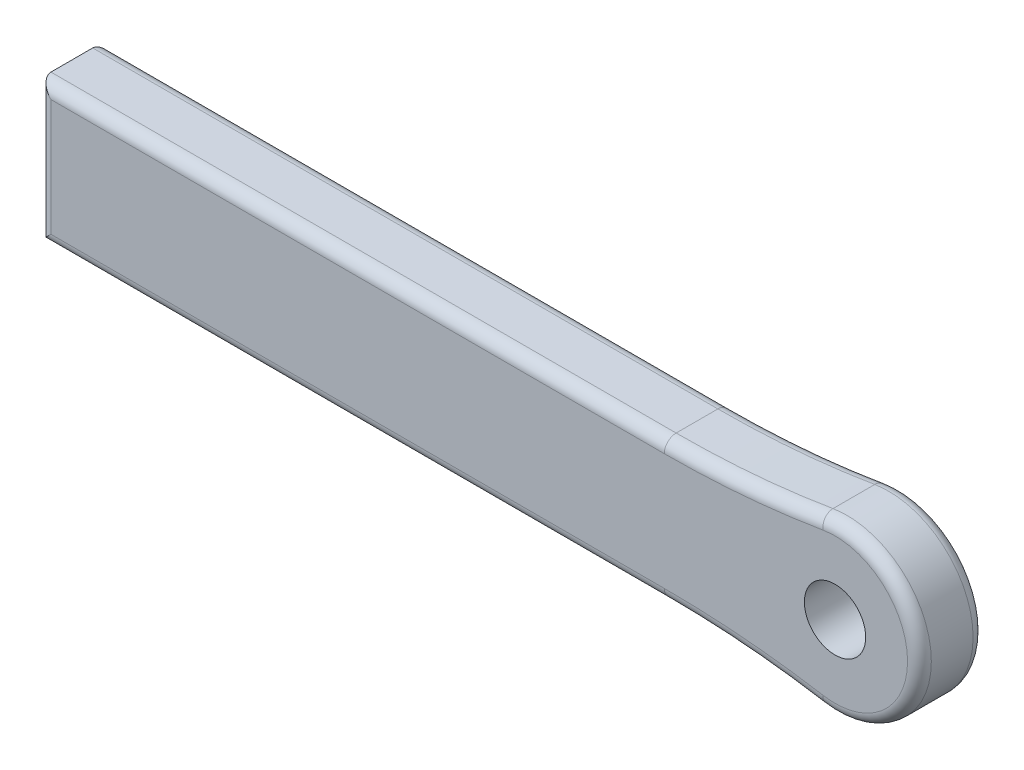
ISO-10303-21;
HEADER;
FILE_DESCRIPTION(('STEP AP214'),'2;1');
FILE_NAME('part.step','',(''),(''),'','','');
FILE_SCHEMA(('AUTOMOTIVE_DESIGN { 1 0 10303 214 1 1 1 1 }'));
ENDSEC;
DATA;
#1=APPLICATION_CONTEXT('core data for automotive mechanical design processes');
#2=APPLICATION_PROTOCOL_DEFINITION('international standard','automotive_design',2000,#1);
#3=PRODUCT_CONTEXT('',#1,'mechanical');
#4=PRODUCT('Part','Part','',(#3));
#5=PRODUCT_RELATED_PRODUCT_CATEGORY('part','',(#4));
#6=PRODUCT_DEFINITION_FORMATION('','',#4);
#7=PRODUCT_DEFINITION_CONTEXT('part definition',#1,'design');
#8=PRODUCT_DEFINITION('design','',#6,#7);
#9=PRODUCT_DEFINITION_SHAPE('','',#8);
#10=(LENGTH_UNIT() NAMED_UNIT(*) SI_UNIT(.MILLI.,.METRE.));
#11=(NAMED_UNIT(*) PLANE_ANGLE_UNIT() SI_UNIT($,.RADIAN.));
#12=(NAMED_UNIT(*) SI_UNIT($,.STERADIAN.) SOLID_ANGLE_UNIT());
#13=UNCERTAINTY_MEASURE_WITH_UNIT(LENGTH_MEASURE(1.E-05),#10,'distance_accuracy_value','');
#14=(GEOMETRIC_REPRESENTATION_CONTEXT(3) GLOBAL_UNCERTAINTY_ASSIGNED_CONTEXT((#13)) GLOBAL_UNIT_ASSIGNED_CONTEXT((#10,
#11,#12)) REPRESENTATION_CONTEXT('',''));
#15=CARTESIAN_POINT('',(0.,0.,0.));
#16=DIRECTION('',(0.,0.,1.));
#17=DIRECTION('',(1.,0.,0.));
#18=AXIS2_PLACEMENT_3D('',#15,#16,#17);
#19=CARTESIAN_POINT('',(-80.0000000000001,-15.,14.));
#20=DIRECTION('',(1.,0.,0.));
#21=DIRECTION('',(0.,0.,-1.));
#22=AXIS2_PLACEMENT_3D('',#19,#20,#21);
#23=PLANE('',#22);
#24=DIRECTION('',(0.,0.,-1.));
#25=VECTOR('',#24,1.);
#26=CARTESIAN_POINT('',(-80.0000000000001,15.,14.));
#27=LINE('',#26,#25);
#28=CARTESIAN_POINT('',(-80.0000000000001,15.,11.46));
#29=VERTEX_POINT('',#28);
#30=CARTESIAN_POINT('',(-80.0000000000001,15.,2.54));
#31=VERTEX_POINT('',#30);
#32=EDGE_CURVE('E181',#29,#31,#27,.T.);
#33=ORIENTED_EDGE('',*,*,#32,.T.);
#34=DIRECTION('',(0.,-1.,0.));
#35=VECTOR('',#34,1.);
#36=CARTESIAN_POINT('',(-80.0000000000001,-15.,2.54));
#37=LINE('',#36,#35);
#38=CARTESIAN_POINT('',(-80.0000000000001,-15.,2.54));
#39=VERTEX_POINT('',#38);
#40=EDGE_CURVE('E11',#31,#39,#37,.T.);
#41=ORIENTED_EDGE('',*,*,#40,.T.);
#42=DIRECTION('',(0.,0.,-1.));
#43=VECTOR('',#42,1.);
#44=CARTESIAN_POINT('',(-80.0000000000001,-15.,14.));
#45=LINE('',#44,#43);
#46=CARTESIAN_POINT('',(-80.0000000000001,-15.,11.46));
#47=VERTEX_POINT('',#46);
#48=EDGE_CURVE('E147',#47,#39,#45,.T.);
#49=ORIENTED_EDGE('',*,*,#48,.F.);
#50=DIRECTION('',(0.,-1.,0.));
#51=VECTOR('',#50,1.);
#52=CARTESIAN_POINT('',(-80.0000000000001,15.,11.46));
#53=LINE('',#52,#51);
#54=EDGE_CURVE('E167',#47,#29,#53,.F.);
#55=ORIENTED_EDGE('',*,*,#54,.T.);
#56=EDGE_LOOP('',(#33,#41,#49,#55));
#57=FACE_BOUND('',#56,.T.);
#58=ADVANCED_FACE('F35',(#57),#23,.F.);
#59=CARTESIAN_POINT('',(-80.0000000000001,-15.,14.));
#60=DIRECTION('',(0.,1.,0.));
#61=DIRECTION('',(-1.,0.,0.));
#62=AXIS2_PLACEMENT_3D('',#59,#60,#61);
#63=PLANE('',#62);
#64=ORIENTED_EDGE('',*,*,#48,.T.);
#65=DIRECTION('',(1.,0.,0.));
#66=VECTOR('',#65,1.);
#67=CARTESIAN_POINT('',(-80.0000000000001,-15.,2.54));
#68=LINE('',#67,#66);
#69=CARTESIAN_POINT('',(53.5242520057116,-15.,2.54));
#70=VERTEX_POINT('',#69);
#71=EDGE_CURVE('E168',#39,#70,#68,.T.);
#72=ORIENTED_EDGE('',*,*,#71,.T.);
#73=DIRECTION('',(0.,0.,-1.));
#74=VECTOR('',#73,1.);
#75=CARTESIAN_POINT('',(53.5242520057116,-15.,14.));
#76=LINE('',#75,#74);
#77=CARTESIAN_POINT('',(53.5242520057116,-15.,11.46));
#78=VERTEX_POINT('',#77);
#79=EDGE_CURVE('E245',#78,#70,#76,.T.);
#80=ORIENTED_EDGE('',*,*,#79,.F.);
#81=DIRECTION('',(1.,0.,0.));
#82=VECTOR('',#81,1.);
#83=CARTESIAN_POINT('',(-80.0000000000001,-15.,11.46));
#84=LINE('',#83,#82);
#85=EDGE_CURVE('E165',#78,#47,#84,.F.);
#86=ORIENTED_EDGE('',*,*,#85,.T.);
#87=EDGE_LOOP('',(#64,#72,#80,#86));
#88=FACE_BOUND('',#87,.T.);
#89=ADVANCED_FACE('F241',(#88),#63,.F.);
#90=CARTESIAN_POINT('',(53.5242520057117,-218.2,14.));
#91=DIRECTION('',(0.,0.,-1.));
#92=DIRECTION('',(-1.,0.,0.));
#93=AXIS2_PLACEMENT_3D('',#90,#91,#92);
#94=CYLINDRICAL_SURFACE('',#93,203.2);
#95=ORIENTED_EDGE('',*,*,#79,.T.);
#96=CARTESIAN_POINT('',(53.5242520057117,-218.2,2.54));
#97=DIRECTION('',(0.,0.,1.));
#98=DIRECTION('',(1.,0.,0.));
#99=AXIS2_PLACEMENT_3D('',#96,#97,#98);
#100=CIRCLE('',#99,203.2);
#101=CARTESIAN_POINT('',(87.0276067104346,-17.7810257896485,2.54));
#102=VERTEX_POINT('',#101);
#103=EDGE_CURVE('E197',#70,#102,#100,.F.);
#104=ORIENTED_EDGE('',*,*,#103,.T.);
#105=DIRECTION('',(0.,0.,-1.));
#106=VECTOR('',#105,1.);
#107=CARTESIAN_POINT('',(87.0276067104346,-17.7810257896485,14.));
#108=LINE('',#107,#106);
#109=CARTESIAN_POINT('',(87.0276067104346,-17.7810257896485,11.46));
#110=VERTEX_POINT('',#109);
#111=EDGE_CURVE('E247',#110,#102,#108,.T.);
#112=ORIENTED_EDGE('',*,*,#111,.F.);
#113=CARTESIAN_POINT('',(53.5242520057117,-218.2,11.46));
#114=DIRECTION('',(0.,0.,1.));
#115=DIRECTION('',(1.,0.,0.));
#116=AXIS2_PLACEMENT_3D('',#113,#114,#115);
#117=CIRCLE('',#116,203.2);
#118=EDGE_CURVE('E163',#110,#78,#117,.T.);
#119=ORIENTED_EDGE('',*,*,#118,.T.);
#120=EDGE_LOOP('',(#95,#104,#112,#119));
#121=FACE_BOUND('',#120,.T.);
#122=ADVANCED_FACE('F302',(#121),#94,.F.);
#123=CARTESIAN_POINT('',(90.,0.,14.));
#124=DIRECTION('',(0.,0.,-1.));
#125=DIRECTION('',(-1.,0.,0.));
#126=AXIS2_PLACEMENT_3D('',#123,#124,#125);
#127=CYLINDRICAL_SURFACE('',#126,18.0277563773199);
#128=ORIENTED_EDGE('',*,*,#111,.T.);
#129=CARTESIAN_POINT('',(90.,0.,2.54));
#130=DIRECTION('',(0.,0.,1.));
#131=DIRECTION('',(1.,0.,0.));
#132=AXIS2_PLACEMENT_3D('',#129,#130,#131);
#133=CIRCLE('',#132,18.0277563773199);
#134=CARTESIAN_POINT('',(87.0276067104346,17.7810257896485,2.54));
#135=VERTEX_POINT('',#134);
#136=EDGE_CURVE('E199',#102,#135,#133,.T.);
#137=ORIENTED_EDGE('',*,*,#136,.T.);
#138=DIRECTION('',(0.,0.,-1.));
#139=VECTOR('',#138,1.);
#140=CARTESIAN_POINT('',(87.0276067104346,17.7810257896485,14.));
#141=LINE('',#140,#139);
#142=CARTESIAN_POINT('',(87.0276067104346,17.7810257896485,11.46));
#143=VERTEX_POINT('',#142);
#144=EDGE_CURVE('E267',#143,#135,#141,.T.);
#145=ORIENTED_EDGE('',*,*,#144,.F.);
#146=CARTESIAN_POINT('',(90.,0.,11.46));
#147=DIRECTION('',(0.,0.,1.));
#148=DIRECTION('',(1.,0.,0.));
#149=AXIS2_PLACEMENT_3D('',#146,#147,#148);
#150=CIRCLE('',#149,18.0277563773199);
#151=EDGE_CURVE('E161',#143,#110,#150,.F.);
#152=ORIENTED_EDGE('',*,*,#151,.T.);
#153=EDGE_LOOP('',(#128,#137,#145,#152));
#154=FACE_BOUND('',#153,.T.);
#155=ADVANCED_FACE('F275',(#154),#127,.T.);
#156=CARTESIAN_POINT('',(53.5242520057116,218.2,14.));
#157=DIRECTION('',(0.,0.,-1.));
#158=DIRECTION('',(-1.,0.,0.));
#159=AXIS2_PLACEMENT_3D('',#156,#157,#158);
#160=CYLINDRICAL_SURFACE('',#159,203.2);
#161=ORIENTED_EDGE('',*,*,#144,.T.);
#162=CARTESIAN_POINT('',(53.5242520057116,218.2,2.54));
#163=DIRECTION('',(0.,0.,1.));
#164=DIRECTION('',(1.,0.,0.));
#165=AXIS2_PLACEMENT_3D('',#162,#163,#164);
#166=CIRCLE('',#165,203.2);
#167=CARTESIAN_POINT('',(53.5242520057116,15.,2.54));
#168=VERTEX_POINT('',#167);
#169=EDGE_CURVE('E59',#135,#168,#166,.F.);
#170=ORIENTED_EDGE('',*,*,#169,.T.);
#171=DIRECTION('',(0.,0.,-1.));
#172=VECTOR('',#171,1.);
#173=CARTESIAN_POINT('',(53.5242520057116,15.,14.));
#174=LINE('',#173,#172);
#175=CARTESIAN_POINT('',(53.5242520057116,15.,11.46));
#176=VERTEX_POINT('',#175);
#177=EDGE_CURVE('E265',#176,#168,#174,.T.);
#178=ORIENTED_EDGE('',*,*,#177,.F.);
#179=CARTESIAN_POINT('',(53.5242520057116,218.2,11.46));
#180=DIRECTION('',(0.,0.,1.));
#181=DIRECTION('',(1.,0.,0.));
#182=AXIS2_PLACEMENT_3D('',#179,#180,#181);
#183=CIRCLE('',#182,203.2);
#184=EDGE_CURVE('E154',#176,#143,#183,.T.);
#185=ORIENTED_EDGE('',*,*,#184,.T.);
#186=EDGE_LOOP('',(#161,#170,#178,#185));
#187=FACE_BOUND('',#186,.T.);
#188=ADVANCED_FACE('F266',(#187),#160,.F.);
#189=CARTESIAN_POINT('',(-80.0000000000001,15.,14.));
#190=DIRECTION('',(0.,-1.,0.));
#191=DIRECTION('',(0.,0.,-1.));
#192=AXIS2_PLACEMENT_3D('',#189,#190,#191);
#193=PLANE('',#192);
#194=ORIENTED_EDGE('',*,*,#177,.T.);
#195=DIRECTION('',(-1.,0.,0.));
#196=VECTOR('',#195,1.);
#197=CARTESIAN_POINT('',(-80.0000000000001,15.,2.54));
#198=LINE('',#197,#196);
#199=EDGE_CURVE('E44',#168,#31,#198,.T.);
#200=ORIENTED_EDGE('',*,*,#199,.T.);
#201=ORIENTED_EDGE('',*,*,#32,.F.);
#202=DIRECTION('',(-1.,0.,0.));
#203=VECTOR('',#202,1.);
#204=CARTESIAN_POINT('',(53.5242520057116,15.,11.46));
#205=LINE('',#204,#203);
#206=EDGE_CURVE('E134',#29,#176,#205,.F.);
#207=ORIENTED_EDGE('',*,*,#206,.T.);
#208=EDGE_LOOP('',(#194,#200,#201,#207));
#209=FACE_BOUND('',#208,.T.);
#210=ADVANCED_FACE('F264',(#209),#193,.F.);
#211=CARTESIAN_POINT('',(53.5242520057116,218.2,14.));
#212=DIRECTION('',(0.,0.,1.));
#213=DIRECTION('',(1.,0.,0.));
#214=AXIS2_PLACEMENT_3D('',#211,#212,#213);
#215=PLANE('',#214);
#216=CARTESIAN_POINT('',(89.9999999999999,0.,14.));
#217=DIRECTION('',(0.,0.,1.));
#218=DIRECTION('',(1.,0.,0.));
#219=AXIS2_PLACEMENT_3D('',#216,#217,#218);
#220=CIRCLE('',#219,6.54812);
#221=CARTESIAN_POINT('',(96.5481199999999,0.,14.));
#222=VERTEX_POINT('',#221);
#223=EDGE_CURVE('E342',#222,#222,#220,.T.);
#224=ORIENTED_EDGE('',*,*,#223,.F.);
#225=EDGE_LOOP('',(#224));
#226=FACE_BOUND('',#225,.T.);
#227=CARTESIAN_POINT('',(53.5242520057116,218.2,14.));
#228=DIRECTION('',(0.,0.,1.));
#229=DIRECTION('',(1.,0.,0.));
#230=AXIS2_PLACEMENT_3D('',#227,#228,#229);
#231=CIRCLE('',#230,205.74);
#232=CARTESIAN_POINT('',(87.4463986442436,15.2757886120192,14.));
#233=VERTEX_POINT('',#232);
#234=CARTESIAN_POINT('',(53.5242520057116,12.46,14.));
#235=VERTEX_POINT('',#234);
#236=EDGE_CURVE('E151',#233,#235,#231,.F.);
#237=ORIENTED_EDGE('',*,*,#236,.T.);
#238=DIRECTION('',(-1.,0.,0.));
#239=VECTOR('',#238,1.);
#240=CARTESIAN_POINT('',(-80.0000000000001,12.46,14.));
#241=LINE('',#240,#239);
#242=CARTESIAN_POINT('',(-77.4600000000001,12.46,14.));
#243=VERTEX_POINT('',#242);
#244=EDGE_CURVE('E132',#235,#243,#241,.T.);
#245=ORIENTED_EDGE('',*,*,#244,.T.);
#246=DIRECTION('',(0.,-1.,0.));
#247=VECTOR('',#246,1.);
#248=CARTESIAN_POINT('',(-77.4600000000001,-15.,14.));
#249=LINE('',#248,#247);
#250=CARTESIAN_POINT('',(-77.4600000000001,-12.46,14.));
#251=VERTEX_POINT('',#250);
#252=EDGE_CURVE('E140',#243,#251,#249,.T.);
#253=ORIENTED_EDGE('',*,*,#252,.T.);
#254=DIRECTION('',(1.,0.,0.));
#255=VECTOR('',#254,1.);
#256=CARTESIAN_POINT('',(53.5242520057116,-12.4599999999999,14.));
#257=LINE('',#256,#255);
#258=CARTESIAN_POINT('',(53.5242520057116,-12.4599999999999,14.));
#259=VERTEX_POINT('',#258);
#260=EDGE_CURVE('E146',#251,#259,#257,.T.);
#261=ORIENTED_EDGE('',*,*,#260,.T.);
#262=CARTESIAN_POINT('',(53.5242520057117,-218.2,14.));
#263=DIRECTION('',(0.,0.,1.));
#264=DIRECTION('',(1.,0.,0.));
#265=AXIS2_PLACEMENT_3D('',#262,#263,#264);
#266=CIRCLE('',#265,205.74);
#267=CARTESIAN_POINT('',(87.4463986442436,-15.2757886120191,14.));
#268=VERTEX_POINT('',#267);
#269=EDGE_CURVE('E252',#259,#268,#266,.F.);
#270=ORIENTED_EDGE('',*,*,#269,.T.);
#271=CARTESIAN_POINT('',(90.,0.,14.));
#272=DIRECTION('',(0.,0.,1.));
#273=DIRECTION('',(1.,0.,0.));
#274=AXIS2_PLACEMENT_3D('',#271,#272,#273);
#275=CIRCLE('',#274,15.4877563773199);
#276=EDGE_CURVE('E156',#268,#233,#275,.T.);
#277=ORIENTED_EDGE('',*,*,#276,.T.);
#278=EDGE_LOOP('',(#237,#245,#253,#261,#270,#277));
#279=FACE_BOUND('',#278,.T.);
#280=ADVANCED_FACE('F149',(#226,#279),#215,.T.);
#281=CARTESIAN_POINT('',(53.5242520057116,218.2,0.));
#282=DIRECTION('',(0.,0.,1.));
#283=DIRECTION('',(1.,0.,0.));
#284=AXIS2_PLACEMENT_3D('',#281,#282,#283);
#285=PLANE('',#284);
#286=CARTESIAN_POINT('',(89.9999999999999,0.,0.));
#287=DIRECTION('',(0.,0.,1.));
#288=DIRECTION('',(1.,0.,0.));
#289=AXIS2_PLACEMENT_3D('',#286,#287,#288);
#290=CIRCLE('',#289,6.54811999999999);
#291=CARTESIAN_POINT('',(96.5481199999999,0.,0.));
#292=VERTEX_POINT('',#291);
#293=EDGE_CURVE('E206',#292,#292,#290,.T.);
#294=ORIENTED_EDGE('',*,*,#293,.T.);
#295=EDGE_LOOP('',(#294));
#296=FACE_BOUND('',#295,.T.);
#297=CARTESIAN_POINT('',(53.5242520057117,-218.2,0.));
#298=DIRECTION('',(0.,0.,1.));
#299=DIRECTION('',(1.,0.,0.));
#300=AXIS2_PLACEMENT_3D('',#297,#298,#299);
#301=CIRCLE('',#300,205.74);
#302=CARTESIAN_POINT('',(87.4463986442436,-15.2757886120191,0.));
#303=VERTEX_POINT('',#302);
#304=CARTESIAN_POINT('',(53.5242520057116,-12.46,0.));
#305=VERTEX_POINT('',#304);
#306=EDGE_CURVE('E192',#303,#305,#301,.T.);
#307=ORIENTED_EDGE('',*,*,#306,.T.);
#308=DIRECTION('',(1.,0.,0.));
#309=VECTOR('',#308,1.);
#310=CARTESIAN_POINT('',(53.5242520057117,-12.4599999999999,0.));
#311=LINE('',#310,#309);
#312=CARTESIAN_POINT('',(-77.4600000000001,-12.46,0.));
#313=VERTEX_POINT('',#312);
#314=EDGE_CURVE('E194',#305,#313,#311,.F.);
#315=ORIENTED_EDGE('',*,*,#314,.T.);
#316=DIRECTION('',(0.,-1.,0.));
#317=VECTOR('',#316,1.);
#318=CARTESIAN_POINT('',(-77.4600000000001,218.2,0.));
#319=LINE('',#318,#317);
#320=CARTESIAN_POINT('',(-77.4600000000001,12.46,0.));
#321=VERTEX_POINT('',#320);
#322=EDGE_CURVE('E184',#313,#321,#319,.F.);
#323=ORIENTED_EDGE('',*,*,#322,.T.);
#324=DIRECTION('',(-1.,0.,0.));
#325=VECTOR('',#324,1.);
#326=CARTESIAN_POINT('',(53.5242520057116,12.46,0.));
#327=LINE('',#326,#325);
#328=CARTESIAN_POINT('',(53.5242520057116,12.46,0.));
#329=VERTEX_POINT('',#328);
#330=EDGE_CURVE('E186',#321,#329,#327,.F.);
#331=ORIENTED_EDGE('',*,*,#330,.T.);
#332=CARTESIAN_POINT('',(53.5242520057116,218.2,0.));
#333=DIRECTION('',(0.,0.,1.));
#334=DIRECTION('',(1.,0.,0.));
#335=AXIS2_PLACEMENT_3D('',#332,#333,#334);
#336=CIRCLE('',#335,205.74);
#337=CARTESIAN_POINT('',(87.4463986442436,15.2757886120192,0.));
#338=VERTEX_POINT('',#337);
#339=EDGE_CURVE('E188',#329,#338,#336,.T.);
#340=ORIENTED_EDGE('',*,*,#339,.T.);
#341=CARTESIAN_POINT('',(90.,0.,0.));
#342=DIRECTION('',(0.,0.,1.));
#343=DIRECTION('',(1.,0.,0.));
#344=AXIS2_PLACEMENT_3D('',#341,#342,#343);
#345=CIRCLE('',#344,15.4877563773199);
#346=EDGE_CURVE('E190',#338,#303,#345,.F.);
#347=ORIENTED_EDGE('',*,*,#346,.T.);
#348=EDGE_LOOP('',(#307,#315,#323,#331,#340,#347));
#349=FACE_BOUND('',#348,.T.);
#350=ADVANCED_FACE('F228',(#296,#349),#285,.F.);
#351=CARTESIAN_POINT('',(53.5242520057117,-218.2,11.46));
#352=DIRECTION('',(0.,0.,1.));
#353=DIRECTION('',(1.,0.,0.));
#354=AXIS2_PLACEMENT_3D('',#351,#352,#353);
#355=TOROIDAL_SURFACE('',#354,205.74,2.54);
#356=CARTESIAN_POINT('',(53.5242520057116,-12.46,11.46));
#357=DIRECTION('',(-1.,0.,0.));
#358=DIRECTION('',(0.,0.,1.));
#359=AXIS2_PLACEMENT_3D('',#356,#357,#358);
#360=CIRCLE('',#359,2.54);
#361=EDGE_CURVE('E175',#78,#259,#360,.T.);
#362=ORIENTED_EDGE('',*,*,#361,.F.);
#363=ORIENTED_EDGE('',*,*,#118,.F.);
#364=CARTESIAN_POINT('',(87.4463986442436,-15.2757886120191,11.46));
#365=DIRECTION('',(0.986313849460391,-0.164878714098046,0.));
#366=DIRECTION('',(0.164878714098046,0.986313849460391,0.));
#367=AXIS2_PLACEMENT_3D('',#364,#365,#366);
#368=CIRCLE('',#367,2.54);
#369=EDGE_CURVE('E178',#268,#110,#368,.T.);
#370=ORIENTED_EDGE('',*,*,#369,.F.);
#371=ORIENTED_EDGE('',*,*,#269,.F.);
#372=EDGE_LOOP('',(#362,#363,#370,#371));
#373=FACE_BOUND('',#372,.T.);
#374=ADVANCED_FACE('F317',(#373),#355,.T.);
#375=CARTESIAN_POINT('',(90.,0.,11.46));
#376=DIRECTION('',(0.,0.,1.));
#377=DIRECTION('',(1.,0.,0.));
#378=AXIS2_PLACEMENT_3D('',#375,#376,#377);
#379=TOROIDAL_SURFACE('',#378,15.4877563773199,2.54);
#380=ORIENTED_EDGE('',*,*,#369,.T.);
#381=ORIENTED_EDGE('',*,*,#151,.F.);
#382=CARTESIAN_POINT('',(87.4463986442436,15.2757886120192,11.46));
#383=DIRECTION('',(-0.986313849460391,-0.164878714098044,0.));
#384=DIRECTION('',(0.164878714098044,-0.986313849460391,0.));
#385=AXIS2_PLACEMENT_3D('',#382,#383,#384);
#386=CIRCLE('',#385,2.54);
#387=EDGE_CURVE('E172',#233,#143,#386,.T.);
#388=ORIENTED_EDGE('',*,*,#387,.F.);
#389=ORIENTED_EDGE('',*,*,#276,.F.);
#390=EDGE_LOOP('',(#380,#381,#388,#389));
#391=FACE_BOUND('',#390,.T.);
#392=ADVANCED_FACE('F259',(#391),#379,.T.);
#393=CARTESIAN_POINT('',(53.5242520057117,-12.4599999999999,11.46));
#394=DIRECTION('',(-1.,0.,0.));
#395=DIRECTION('',(0.,-1.,0.));
#396=AXIS2_PLACEMENT_3D('',#393,#394,#395);
#397=CYLINDRICAL_SURFACE('',#396,2.54);
#398=ORIENTED_EDGE('',*,*,#361,.T.);
#399=ORIENTED_EDGE('',*,*,#260,.F.);
#400=CARTESIAN_POINT('',(-77.4600000000001,-12.46,11.46));
#401=DIRECTION('',(-0.707106781186548,0.707106781186547,0.));
#402=DIRECTION('',(0.707106781186547,0.707106781186548,0.));
#403=AXIS2_PLACEMENT_3D('',#400,#401,#402);
#404=ELLIPSE('',#403,3.59210244842766,2.54);
#405=EDGE_CURVE('E143',#47,#251,#404,.T.);
#406=ORIENTED_EDGE('',*,*,#405,.F.);
#407=ORIENTED_EDGE('',*,*,#85,.F.);
#408=EDGE_LOOP('',(#398,#399,#406,#407));
#409=FACE_BOUND('',#408,.T.);
#410=ADVANCED_FACE('F312',(#409),#397,.T.);
#411=CARTESIAN_POINT('',(53.5242520057116,218.2,11.46));
#412=DIRECTION('',(0.,0.,1.));
#413=DIRECTION('',(1.,0.,0.));
#414=AXIS2_PLACEMENT_3D('',#411,#412,#413);
#415=TOROIDAL_SURFACE('',#414,205.74,2.54);
#416=ORIENTED_EDGE('',*,*,#387,.T.);
#417=ORIENTED_EDGE('',*,*,#184,.F.);
#418=CARTESIAN_POINT('',(53.5242520057116,12.46,11.46));
#419=DIRECTION('',(-1.,0.,0.));
#420=DIRECTION('',(0.,0.,1.));
#421=AXIS2_PLACEMENT_3D('',#418,#419,#420);
#422=CIRCLE('',#421,2.54);
#423=EDGE_CURVE('E137',#235,#176,#422,.T.);
#424=ORIENTED_EDGE('',*,*,#423,.F.);
#425=ORIENTED_EDGE('',*,*,#236,.F.);
#426=EDGE_LOOP('',(#416,#417,#424,#425));
#427=FACE_BOUND('',#426,.T.);
#428=ADVANCED_FACE('F262',(#427),#415,.T.);
#429=CARTESIAN_POINT('',(-77.4600000000001,218.2,11.46));
#430=DIRECTION('',(0.,1.,0.));
#431=DIRECTION('',(0.,0.,1.));
#432=AXIS2_PLACEMENT_3D('',#429,#430,#431);
#433=CYLINDRICAL_SURFACE('',#432,2.54);
#434=ORIENTED_EDGE('',*,*,#405,.T.);
#435=ORIENTED_EDGE('',*,*,#252,.F.);
#436=CARTESIAN_POINT('',(-77.4600000000001,12.46,11.46));
#437=DIRECTION('',(0.707106781186547,0.707106781186547,0.));
#438=DIRECTION('',(-0.707106781186547,0.707106781186547,0.));
#439=AXIS2_PLACEMENT_3D('',#436,#437,#438);
#440=ELLIPSE('',#439,3.59210244842766,2.54);
#441=EDGE_CURVE('E128',#29,#243,#440,.T.);
#442=ORIENTED_EDGE('',*,*,#441,.F.);
#443=ORIENTED_EDGE('',*,*,#54,.F.);
#444=EDGE_LOOP('',(#434,#435,#442,#443));
#445=FACE_BOUND('',#444,.T.);
#446=ADVANCED_FACE('F141',(#445),#433,.T.);
#447=CARTESIAN_POINT('',(53.5242520057116,12.46,11.46));
#448=DIRECTION('',(1.,0.,0.));
#449=DIRECTION('',(0.,0.,-1.));
#450=AXIS2_PLACEMENT_3D('',#447,#448,#449);
#451=CYLINDRICAL_SURFACE('',#450,2.54);
#452=ORIENTED_EDGE('',*,*,#423,.T.);
#453=ORIENTED_EDGE('',*,*,#206,.F.);
#454=ORIENTED_EDGE('',*,*,#441,.T.);
#455=ORIENTED_EDGE('',*,*,#244,.F.);
#456=EDGE_LOOP('',(#452,#453,#454,#455));
#457=FACE_BOUND('',#456,.T.);
#458=ADVANCED_FACE('F130',(#457),#451,.T.);
#459=CARTESIAN_POINT('',(53.5242520057116,218.2,2.54));
#460=DIRECTION('',(0.,0.,1.));
#461=DIRECTION('',(1.,0.,0.));
#462=AXIS2_PLACEMENT_3D('',#459,#460,#461);
#463=TOROIDAL_SURFACE('',#462,205.74,2.54);
#464=CARTESIAN_POINT('',(87.4463986442436,15.2757886120192,2.54));
#465=DIRECTION('',(0.98631384946039,0.16487871409805,0.));
#466=DIRECTION('',(-0.16487871409805,0.986313849460391,0.));
#467=AXIS2_PLACEMENT_3D('',#464,#465,#466);
#468=CIRCLE('',#467,2.54);
#469=EDGE_CURVE('E213',#338,#135,#468,.T.);
#470=ORIENTED_EDGE('',*,*,#469,.F.);
#471=ORIENTED_EDGE('',*,*,#339,.F.);
#472=CARTESIAN_POINT('',(53.5242520057116,12.46,2.54));
#473=DIRECTION('',(-1.,0.,0.));
#474=DIRECTION('',(0.,0.,1.));
#475=AXIS2_PLACEMENT_3D('',#472,#473,#474);
#476=CIRCLE('',#475,2.54);
#477=EDGE_CURVE('E39',#168,#329,#476,.T.);
#478=ORIENTED_EDGE('',*,*,#477,.F.);
#479=ORIENTED_EDGE('',*,*,#169,.F.);
#480=EDGE_LOOP('',(#470,#471,#478,#479));
#481=FACE_BOUND('',#480,.T.);
#482=ADVANCED_FACE('F37',(#481),#463,.T.);
#483=CARTESIAN_POINT('',(-80.0000000000001,12.46,2.54));
#484=DIRECTION('',(-1.,0.,0.));
#485=DIRECTION('',(0.,0.,1.));
#486=AXIS2_PLACEMENT_3D('',#483,#484,#485);
#487=CYLINDRICAL_SURFACE('',#486,2.54);
#488=ORIENTED_EDGE('',*,*,#477,.T.);
#489=ORIENTED_EDGE('',*,*,#330,.F.);
#490=CARTESIAN_POINT('',(-77.4600000000001,12.46,2.54));
#491=DIRECTION('',(-0.707106781186547,-0.707106781186547,0.));
#492=DIRECTION('',(0.707106781186547,-0.707106781186547,0.));
#493=AXIS2_PLACEMENT_3D('',#490,#491,#492);
#494=ELLIPSE('',#493,3.59210244842766,2.54);
#495=EDGE_CURVE('E211',#31,#321,#494,.T.);
#496=ORIENTED_EDGE('',*,*,#495,.F.);
#497=ORIENTED_EDGE('',*,*,#199,.F.);
#498=EDGE_LOOP('',(#488,#489,#496,#497));
#499=FACE_BOUND('',#498,.T.);
#500=ADVANCED_FACE('F223',(#499),#487,.T.);
#501=CARTESIAN_POINT('',(90.,0.,2.54));
#502=DIRECTION('',(0.,0.,1.));
#503=DIRECTION('',(1.,0.,0.));
#504=AXIS2_PLACEMENT_3D('',#501,#502,#503);
#505=TOROIDAL_SURFACE('',#504,15.4877563773199,2.54);
#506=ORIENTED_EDGE('',*,*,#469,.T.);
#507=ORIENTED_EDGE('',*,*,#136,.F.);
#508=CARTESIAN_POINT('',(87.4463986442436,-15.2757886120191,2.54));
#509=DIRECTION('',(-0.986313849460391,0.164878714098044,0.));
#510=DIRECTION('',(-0.164878714098044,-0.986313849460391,0.));
#511=AXIS2_PLACEMENT_3D('',#508,#509,#510);
#512=CIRCLE('',#511,2.54);
#513=EDGE_CURVE('E208',#303,#102,#512,.T.);
#514=ORIENTED_EDGE('',*,*,#513,.F.);
#515=ORIENTED_EDGE('',*,*,#346,.F.);
#516=EDGE_LOOP('',(#506,#507,#514,#515));
#517=FACE_BOUND('',#516,.T.);
#518=ADVANCED_FACE('F278',(#517),#505,.T.);
#519=CARTESIAN_POINT('',(-77.4600000000001,-15.,2.54));
#520=DIRECTION('',(0.,-1.,0.));
#521=DIRECTION('',(0.,0.,-1.));
#522=AXIS2_PLACEMENT_3D('',#519,#520,#521);
#523=CYLINDRICAL_SURFACE('',#522,2.54);
#524=ORIENTED_EDGE('',*,*,#495,.T.);
#525=ORIENTED_EDGE('',*,*,#322,.F.);
#526=CARTESIAN_POINT('',(-77.4600000000001,-12.46,2.54));
#527=DIRECTION('',(0.707106781186548,-0.707106781186547,0.));
#528=DIRECTION('',(-0.707106781186547,-0.707106781186548,0.));
#529=AXIS2_PLACEMENT_3D('',#526,#527,#528);
#530=ELLIPSE('',#529,3.59210244842766,2.54);
#531=EDGE_CURVE('E205',#39,#313,#530,.T.);
#532=ORIENTED_EDGE('',*,*,#531,.F.);
#533=ORIENTED_EDGE('',*,*,#40,.F.);
#534=EDGE_LOOP('',(#524,#525,#532,#533));
#535=FACE_BOUND('',#534,.T.);
#536=ADVANCED_FACE('F234',(#535),#523,.T.);
#537=CARTESIAN_POINT('',(53.5242520057117,-218.2,2.54));
#538=DIRECTION('',(0.,0.,1.));
#539=DIRECTION('',(1.,0.,0.));
#540=AXIS2_PLACEMENT_3D('',#537,#538,#539);
#541=TOROIDAL_SURFACE('',#540,205.74,2.54);
#542=ORIENTED_EDGE('',*,*,#513,.T.);
#543=ORIENTED_EDGE('',*,*,#103,.F.);
#544=CARTESIAN_POINT('',(53.5242520057116,-12.46,2.54));
#545=DIRECTION('',(-1.,0.,0.));
#546=DIRECTION('',(0.,0.,1.));
#547=AXIS2_PLACEMENT_3D('',#544,#545,#546);
#548=CIRCLE('',#547,2.54);
#549=EDGE_CURVE('E203',#305,#70,#548,.T.);
#550=ORIENTED_EDGE('',*,*,#549,.F.);
#551=ORIENTED_EDGE('',*,*,#306,.F.);
#552=EDGE_LOOP('',(#542,#543,#550,#551));
#553=FACE_BOUND('',#552,.T.);
#554=ADVANCED_FACE('F282',(#553),#541,.T.);
#555=CARTESIAN_POINT('',(-80.0000000000001,-12.46,2.54));
#556=DIRECTION('',(1.,0.,0.));
#557=DIRECTION('',(0.,1.,0.));
#558=AXIS2_PLACEMENT_3D('',#555,#556,#557);
#559=CYLINDRICAL_SURFACE('',#558,2.54);
#560=ORIENTED_EDGE('',*,*,#531,.T.);
#561=ORIENTED_EDGE('',*,*,#314,.F.);
#562=ORIENTED_EDGE('',*,*,#549,.T.);
#563=ORIENTED_EDGE('',*,*,#71,.F.);
#564=EDGE_LOOP('',(#560,#561,#562,#563));
#565=FACE_BOUND('',#564,.T.);
#566=ADVANCED_FACE('F285',(#565),#559,.T.);
#567=CARTESIAN_POINT('',(89.9999999999999,0.,14.));
#568=DIRECTION('',(0.,0.,1.));
#569=DIRECTION('',(1.,0.,0.));
#570=AXIS2_PLACEMENT_3D('',#567,#568,#569);
#571=CYLINDRICAL_SURFACE('',#570,6.54812);
#572=ORIENTED_EDGE('',*,*,#293,.F.);
#573=EDGE_LOOP('',(#572));
#574=FACE_BOUND('',#573,.T.);
#575=ORIENTED_EDGE('',*,*,#223,.T.);
#576=EDGE_LOOP('',(#575));
#577=FACE_BOUND('',#576,.T.);
#578=ADVANCED_FACE('F287',(#574,#577),#571,.F.);
#579=CLOSED_SHELL('',(#58,#89,#122,#155,#188,#210,#280,#350,#374,#392,#410,#428,#446,#458,#482,
#500,#518,#536,#554,#566,#578));
#580=MANIFOLD_SOLID_BREP('B2',#579);
#581=ADVANCED_BREP_SHAPE_REPRESENTATION('',(#18,#580),#14);
#582=SHAPE_DEFINITION_REPRESENTATION(#9,#581);
ENDSEC;
END-ISO-10303-21;
